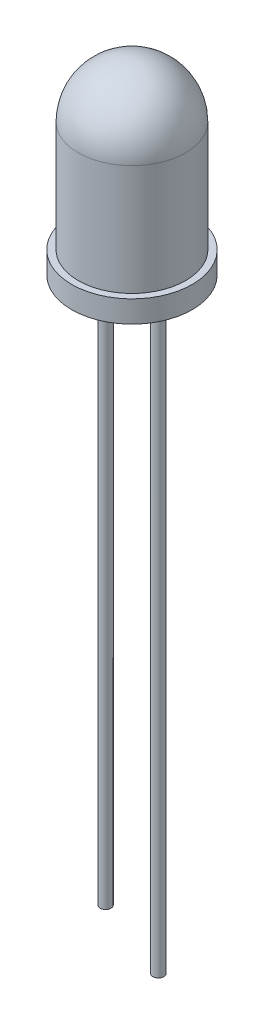
ISO-10303-21;
HEADER;
FILE_DESCRIPTION(('STEP AP214'),'2;1');
FILE_NAME('part.step','',(''),(''),'','','');
FILE_SCHEMA(('AUTOMOTIVE_DESIGN { 1 0 10303 214 1 1 1 1 }'));
ENDSEC;
DATA;
#1=APPLICATION_CONTEXT('core data for automotive mechanical design processes');
#2=APPLICATION_PROTOCOL_DEFINITION('international standard','automotive_design',2000,#1);
#3=PRODUCT_CONTEXT('',#1,'mechanical');
#4=PRODUCT('Part','Part','',(#3));
#5=PRODUCT_RELATED_PRODUCT_CATEGORY('part','',(#4));
#6=PRODUCT_DEFINITION_FORMATION('','',#4);
#7=PRODUCT_DEFINITION_CONTEXT('part definition',#1,'design');
#8=PRODUCT_DEFINITION('design','',#6,#7);
#9=PRODUCT_DEFINITION_SHAPE('','',#8);
#10=(LENGTH_UNIT() NAMED_UNIT(*) SI_UNIT(.MILLI.,.METRE.));
#11=(NAMED_UNIT(*) PLANE_ANGLE_UNIT() SI_UNIT($,.RADIAN.));
#12=(NAMED_UNIT(*) SI_UNIT($,.STERADIAN.) SOLID_ANGLE_UNIT());
#13=UNCERTAINTY_MEASURE_WITH_UNIT(LENGTH_MEASURE(1.E-05),#10,'distance_accuracy_value','');
#14=(GEOMETRIC_REPRESENTATION_CONTEXT(3) GLOBAL_UNCERTAINTY_ASSIGNED_CONTEXT((#13)) GLOBAL_UNIT_ASSIGNED_CONTEXT((#10,
#11,#12)) REPRESENTATION_CONTEXT('',''));
#15=CARTESIAN_POINT('',(0.,0.,0.));
#16=DIRECTION('',(0.,0.,1.));
#17=DIRECTION('',(1.,0.,0.));
#18=AXIS2_PLACEMENT_3D('',#15,#16,#17);
#19=CARTESIAN_POINT('',(0.,1.,0.));
#20=DIRECTION('',(0.,-1.,0.));
#21=DIRECTION('',(0.,0.,-1.));
#22=AXIS2_PLACEMENT_3D('',#19,#20,#21);
#23=CYLINDRICAL_SURFACE('',#22,2.75);
#24=CARTESIAN_POINT('',(0.,1.,0.));
#25=DIRECTION('',(0.,1.,0.));
#26=DIRECTION('',(0.,0.,1.));
#27=AXIS2_PLACEMENT_3D('',#24,#25,#26);
#28=CIRCLE('',#27,2.75);
#29=CARTESIAN_POINT('',(0.,1.,2.75));
#30=VERTEX_POINT('',#29);
#31=EDGE_CURVE('E46',#30,#30,#28,.T.);
#32=ORIENTED_EDGE('',*,*,#31,.F.);
#33=EDGE_LOOP('',(#32));
#34=FACE_BOUND('',#33,.T.);
#35=CARTESIAN_POINT('',(0.,0.,0.));
#36=DIRECTION('',(0.,1.,0.));
#37=DIRECTION('',(0.,0.,1.));
#38=AXIS2_PLACEMENT_3D('',#35,#36,#37);
#39=CIRCLE('',#38,2.75);
#40=CARTESIAN_POINT('',(0.,0.,2.75));
#41=VERTEX_POINT('',#40);
#42=EDGE_CURVE('E52',#41,#41,#39,.T.);
#43=ORIENTED_EDGE('',*,*,#42,.T.);
#44=EDGE_LOOP('',(#43));
#45=FACE_BOUND('',#44,.T.);
#46=ADVANCED_FACE('F31',(#34,#45),#23,.T.);
#47=CARTESIAN_POINT('',(0.,1.,0.));
#48=DIRECTION('',(0.,1.,0.));
#49=DIRECTION('',(0.,0.,1.));
#50=AXIS2_PLACEMENT_3D('',#47,#48,#49);
#51=PLANE('',#50);
#52=CARTESIAN_POINT('',(0.,1.,0.));
#53=DIRECTION('',(0.,1.,0.));
#54=DIRECTION('',(0.,0.,1.));
#55=AXIS2_PLACEMENT_3D('',#52,#53,#54);
#56=CIRCLE('',#55,2.45);
#57=CARTESIAN_POINT('',(0.,1.,2.45));
#58=VERTEX_POINT('',#57);
#59=EDGE_CURVE('E42',#58,#58,#56,.T.);
#60=ORIENTED_EDGE('',*,*,#59,.F.);
#61=EDGE_LOOP('',(#60));
#62=FACE_BOUND('',#61,.T.);
#63=ORIENTED_EDGE('',*,*,#31,.T.);
#64=EDGE_LOOP('',(#63));
#65=FACE_BOUND('',#64,.T.);
#66=ADVANCED_FACE('F79',(#62,#65),#51,.T.);
#67=CARTESIAN_POINT('',(0.,0.,0.));
#68=DIRECTION('',(0.,1.,0.));
#69=DIRECTION('',(0.,0.,1.));
#70=AXIS2_PLACEMENT_3D('',#67,#68,#69);
#71=PLANE('',#70);
#72=CARTESIAN_POINT('',(1.20516202768511,0.,0.));
#73=DIRECTION('',(0.,1.,0.));
#74=DIRECTION('',(0.,0.,1.));
#75=AXIS2_PLACEMENT_3D('',#72,#73,#74);
#76=CIRCLE('',#75,0.25);
#77=CARTESIAN_POINT('',(1.20516202768511,0.,0.25));
#78=VERTEX_POINT('',#77);
#79=EDGE_CURVE('E10',#78,#78,#76,.F.);
#80=ORIENTED_EDGE('',*,*,#79,.F.);
#81=EDGE_LOOP('',(#80));
#82=FACE_BOUND('',#81,.T.);
#83=CARTESIAN_POINT('',(-1.20516202768511,0.,0.));
#84=DIRECTION('',(0.,1.,0.));
#85=DIRECTION('',(0.,0.,1.));
#86=AXIS2_PLACEMENT_3D('',#83,#84,#85);
#87=CIRCLE('',#86,0.25);
#88=CARTESIAN_POINT('',(-1.20516202768511,0.,0.25));
#89=VERTEX_POINT('',#88);
#90=EDGE_CURVE('E38',#89,#89,#87,.F.);
#91=ORIENTED_EDGE('',*,*,#90,.F.);
#92=EDGE_LOOP('',(#91));
#93=FACE_BOUND('',#92,.T.);
#94=ORIENTED_EDGE('',*,*,#42,.F.);
#95=EDGE_LOOP('',(#94));
#96=FACE_BOUND('',#95,.T.);
#97=ADVANCED_FACE('F84',(#82,#93,#96),#71,.F.);
#98=CARTESIAN_POINT('',(0.,6.05,0.));
#99=DIRECTION('',(0.,-1.,0.));
#100=DIRECTION('',(0.,0.,-1.));
#101=AXIS2_PLACEMENT_3D('',#98,#99,#100);
#102=CYLINDRICAL_SURFACE('',#101,2.45);
#103=CARTESIAN_POINT('',(0.,6.05,0.));
#104=DIRECTION('',(0.,1.,0.));
#105=DIRECTION('',(0.,0.,1.));
#106=AXIS2_PLACEMENT_3D('',#103,#104,#105);
#107=CIRCLE('',#106,2.45);
#108=CARTESIAN_POINT('',(0.,6.05,2.45));
#109=VERTEX_POINT('',#108);
#110=EDGE_CURVE('E49',#109,#109,#107,.T.);
#111=ORIENTED_EDGE('',*,*,#110,.F.);
#112=EDGE_LOOP('',(#111));
#113=FACE_BOUND('',#112,.T.);
#114=ORIENTED_EDGE('',*,*,#59,.T.);
#115=EDGE_LOOP('',(#114));
#116=FACE_BOUND('',#115,.T.);
#117=ADVANCED_FACE('F91',(#113,#116),#102,.T.);
#118=CARTESIAN_POINT('',(0.,6.05,0.));
#119=DIRECTION('',(0.,0.,1.));
#120=DIRECTION('',(1.,0.,0.));
#121=AXIS2_PLACEMENT_3D('',#118,#119,#120);
#122=SPHERICAL_SURFACE('',#121,2.45);
#123=CARTESIAN_POINT('',(0.,6.05,0.));
#124=DIRECTION('',(0.,1.,0.));
#125=DIRECTION('',(0.,0.,1.));
#126=AXIS2_PLACEMENT_3D('',#123,#124,#125);
#127=SPHERICAL_SURFACE('',#126,2.45);
#128=ORIENTED_EDGE('',*,*,#110,.T.);
#129=EDGE_LOOP('',(#128));
#130=FACE_BOUND('',#129,.T.);
#131=ADVANCED_FACE('F33',(#130),#127,.T.);
#132=CARTESIAN_POINT('',(-1.20516202768511,-26.2071067811866,0.));
#133=DIRECTION('',(0.,1.,0.));
#134=DIRECTION('',(0.,0.,1.));
#135=AXIS2_PLACEMENT_3D('',#132,#133,#134);
#136=CYLINDRICAL_SURFACE('',#135,0.25);
#137=CARTESIAN_POINT('',(-1.20516202768511,-25.5,0.));
#138=DIRECTION('',(0.,1.,0.));
#139=DIRECTION('',(-1.,0.,0.));
#140=AXIS2_PLACEMENT_3D('',#137,#138,#139);
#141=CIRCLE('',#140,0.25);
#142=CARTESIAN_POINT('',(-1.45516202768511,-25.5,0.));
#143=VERTEX_POINT('',#142);
#144=EDGE_CURVE('E53',#143,#143,#141,.T.);
#145=ORIENTED_EDGE('',*,*,#144,.T.);
#146=EDGE_LOOP('',(#145));
#147=FACE_BOUND('',#146,.T.);
#148=ORIENTED_EDGE('',*,*,#90,.T.);
#149=EDGE_LOOP('',(#148));
#150=FACE_BOUND('',#149,.T.);
#151=ADVANCED_FACE('F75',(#147,#150),#136,.T.);
#152=CARTESIAN_POINT('',(40.0034461232128,-25.5,-15.9240493439346));
#153=DIRECTION('',(0.,1.,0.));
#154=DIRECTION('',(-0.0494210085027144,0.,-0.998778035360497));
#155=AXIS2_PLACEMENT_3D('',#152,#153,#154);
#156=PLANE('',#155);
#157=ORIENTED_EDGE('',*,*,#144,.F.);
#158=EDGE_LOOP('',(#157));
#159=FACE_BOUND('',#158,.T.);
#160=ADVANCED_FACE('F68',(#159),#156,.F.);
#161=CARTESIAN_POINT('',(1.20516202768511,-27.,0.));
#162=DIRECTION('',(0.,1.,0.));
#163=DIRECTION('',(0.,0.,1.));
#164=AXIS2_PLACEMENT_3D('',#161,#162,#163);
#165=CYLINDRICAL_SURFACE('',#164,0.25);
#166=CARTESIAN_POINT('',(1.20516202768511,-27.,0.));
#167=DIRECTION('',(0.,-1.,0.));
#168=DIRECTION('',(0.,0.,-1.));
#169=AXIS2_PLACEMENT_3D('',#166,#167,#168);
#170=CIRCLE('',#169,0.25);
#171=CARTESIAN_POINT('',(1.20516202768511,-27.,-0.25));
#172=VERTEX_POINT('',#171);
#173=EDGE_CURVE('E60',#172,#172,#170,.T.);
#174=ORIENTED_EDGE('',*,*,#173,.F.);
#175=EDGE_LOOP('',(#174));
#176=FACE_BOUND('',#175,.T.);
#177=ORIENTED_EDGE('',*,*,#79,.T.);
#178=EDGE_LOOP('',(#177));
#179=FACE_BOUND('',#178,.T.);
#180=ADVANCED_FACE('F66',(#176,#179),#165,.T.);
#181=CARTESIAN_POINT('',(1.20516202768511,-27.,0.));
#182=DIRECTION('',(0.,-1.,0.));
#183=DIRECTION('',(0.,0.,-1.));
#184=AXIS2_PLACEMENT_3D('',#181,#182,#183);
#185=PLANE('',#184);
#186=ORIENTED_EDGE('',*,*,#173,.T.);
#187=EDGE_LOOP('',(#186));
#188=FACE_BOUND('',#187,.T.);
#189=ADVANCED_FACE('F64',(#188),#185,.T.);
#190=CLOSED_SHELL('',(#46,#66,#97,#117,#131,#151,#160,#180,#189));
#191=MANIFOLD_SOLID_BREP('B2',#190);
#192=ADVANCED_BREP_SHAPE_REPRESENTATION('',(#18,#191),#14);
#193=SHAPE_DEFINITION_REPRESENTATION(#9,#192);
ENDSEC;
END-ISO-10303-21;
